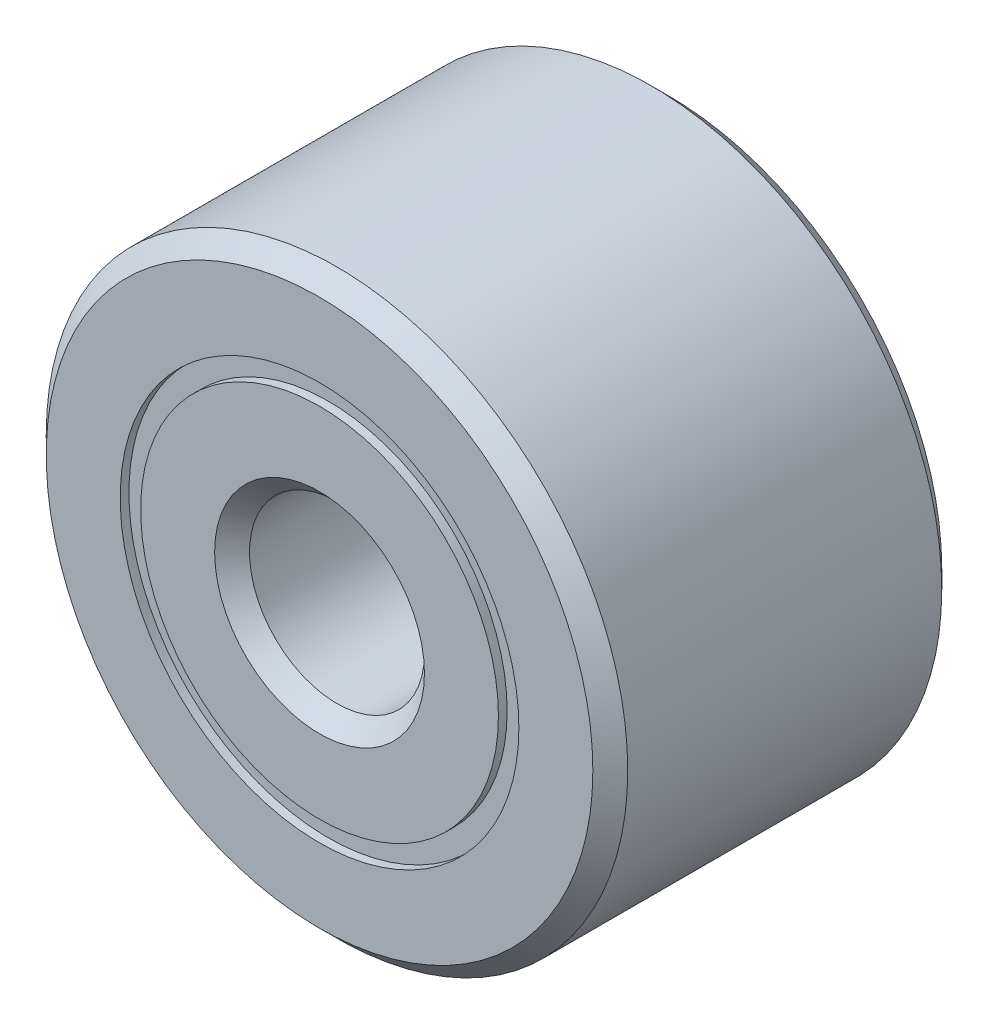
ISO-10303-21;
HEADER;
FILE_DESCRIPTION(('STEP AP214'),'2;1');
FILE_NAME('part.step','',(''),(''),'','','');
FILE_SCHEMA(('AUTOMOTIVE_DESIGN { 1 0 10303 214 1 1 1 1 }'));
ENDSEC;
DATA;
#1=APPLICATION_CONTEXT('core data for automotive mechanical design processes');
#2=APPLICATION_PROTOCOL_DEFINITION('international standard','automotive_design',2000,#1);
#3=PRODUCT_CONTEXT('',#1,'mechanical');
#4=PRODUCT('Part','Part','',(#3));
#5=PRODUCT_RELATED_PRODUCT_CATEGORY('part','',(#4));
#6=PRODUCT_DEFINITION_FORMATION('','',#4);
#7=PRODUCT_DEFINITION_CONTEXT('part definition',#1,'design');
#8=PRODUCT_DEFINITION('design','',#6,#7);
#9=PRODUCT_DEFINITION_SHAPE('','',#8);
#10=(LENGTH_UNIT() NAMED_UNIT(*) SI_UNIT(.MILLI.,.METRE.));
#11=(NAMED_UNIT(*) PLANE_ANGLE_UNIT() SI_UNIT($,.RADIAN.));
#12=(NAMED_UNIT(*) SI_UNIT($,.STERADIAN.) SOLID_ANGLE_UNIT());
#13=UNCERTAINTY_MEASURE_WITH_UNIT(LENGTH_MEASURE(1.E-05),#10,'distance_accuracy_value','');
#14=(GEOMETRIC_REPRESENTATION_CONTEXT(3) GLOBAL_UNCERTAINTY_ASSIGNED_CONTEXT((#13)) GLOBAL_UNIT_ASSIGNED_CONTEXT((#10,
#11,#12)) REPRESENTATION_CONTEXT('',''));
#15=CARTESIAN_POINT('',(0.,0.,0.));
#16=DIRECTION('',(0.,0.,1.));
#17=DIRECTION('',(1.,0.,0.));
#18=AXIS2_PLACEMENT_3D('',#15,#16,#17);
#19=CARTESIAN_POINT('',(0.,1.3604177197802,-1.13109375));
#20=DIRECTION('',(0.,0.,1.));
#21=DIRECTION('',(1.,0.,0.));
#22=AXIS2_PLACEMENT_3D('',#19,#20,#21);
#23=PLANE('',#22);
#24=CARTESIAN_POINT('',(0.,0.,-1.13109375));
#25=DIRECTION('',(0.,0.,1.));
#26=DIRECTION('',(1.,0.,0.));
#27=AXIS2_PLACEMENT_3D('',#24,#25,#26);
#28=CIRCLE('',#27,1.36041771978022);
#29=CARTESIAN_POINT('',(1.36041771978022,0.,-1.13109375));
#30=VERTEX_POINT('',#29);
#31=EDGE_CURVE('E57',#30,#30,#28,.T.);
#32=ORIENTED_EDGE('',*,*,#31,.F.);
#33=EDGE_LOOP('',(#32));
#34=FACE_BOUND('',#33,.T.);
#35=CARTESIAN_POINT('',(0.,0.,-1.13109375));
#36=DIRECTION('',(0.,0.,1.));
#37=DIRECTION('',(1.,0.,0.));
#38=AXIS2_PLACEMENT_3D('',#35,#36,#37);
#39=CIRCLE('',#38,1.22085728021978);
#40=CARTESIAN_POINT('',(1.22085728021978,0.,-1.13109375));
#41=VERTEX_POINT('',#40);
#42=EDGE_CURVE('E11',#41,#41,#39,.T.);
#43=ORIENTED_EDGE('',*,*,#42,.T.);
#44=EDGE_LOOP('',(#43));
#45=FACE_BOUND('',#44,.T.);
#46=ADVANCED_FACE('F43',(#34,#45),#23,.F.);
#47=CARTESIAN_POINT('',(0.,0.,1.19062499999999));
#48=DIRECTION('',(0.,0.,1.));
#49=DIRECTION('',(1.,0.,0.));
#50=AXIS2_PLACEMENT_3D('',#47,#48,#49);
#51=CYLINDRICAL_SURFACE('',#50,1.22085728021978);
#52=ORIENTED_EDGE('',*,*,#42,.F.);
#53=EDGE_LOOP('',(#52));
#54=FACE_BOUND('',#53,.T.);
#55=CARTESIAN_POINT('',(0.,0.,-0.533747730846405));
#56=DIRECTION('',(0.,0.,1.));
#57=DIRECTION('',(1.,0.,0.));
#58=AXIS2_PLACEMENT_3D('',#55,#56,#57);
#59=CIRCLE('',#58,1.22085728021978);
#60=CARTESIAN_POINT('',(1.22085728021978,0.,-0.533747730846405));
#61=VERTEX_POINT('',#60);
#62=EDGE_CURVE('E49',#61,#61,#59,.T.);
#63=ORIENTED_EDGE('',*,*,#62,.T.);
#64=EDGE_LOOP('',(#63));
#65=FACE_BOUND('',#64,.T.);
#66=ADVANCED_FACE('F66',(#54,#65),#51,.F.);
#67=CARTESIAN_POINT('',(0.,1.3604177197802,-0.533747730846404));
#68=DIRECTION('',(0.,0.,-1.));
#69=DIRECTION('',(-1.,0.,0.));
#70=AXIS2_PLACEMENT_3D('',#67,#68,#69);
#71=PLANE('',#70);
#72=ORIENTED_EDGE('',*,*,#62,.F.);
#73=EDGE_LOOP('',(#72));
#74=FACE_BOUND('',#73,.T.);
#75=CARTESIAN_POINT('',(0.,0.,-0.533747730846405));
#76=DIRECTION('',(0.,0.,1.));
#77=DIRECTION('',(1.,0.,0.));
#78=AXIS2_PLACEMENT_3D('',#75,#76,#77);
#79=CIRCLE('',#78,1.36041771978022);
#80=CARTESIAN_POINT('',(1.36041771978022,0.,-0.533747730846405));
#81=VERTEX_POINT('',#80);
#82=EDGE_CURVE('E53',#81,#81,#79,.T.);
#83=ORIENTED_EDGE('',*,*,#82,.T.);
#84=EDGE_LOOP('',(#83));
#85=FACE_BOUND('',#84,.T.);
#86=ADVANCED_FACE('F70',(#74,#85),#71,.F.);
#87=CARTESIAN_POINT('',(0.,0.,1.19062499999999));
#88=DIRECTION('',(0.,0.,1.));
#89=DIRECTION('',(1.,0.,0.));
#90=AXIS2_PLACEMENT_3D('',#87,#88,#89);
#91=CYLINDRICAL_SURFACE('',#90,1.36041771978022);
#92=ORIENTED_EDGE('',*,*,#82,.F.);
#93=EDGE_LOOP('',(#92));
#94=FACE_BOUND('',#93,.T.);
#95=ORIENTED_EDGE('',*,*,#31,.T.);
#96=EDGE_LOOP('',(#95));
#97=FACE_BOUND('',#96,.T.);
#98=ADVANCED_FACE('F63',(#94,#97),#91,.T.);
#99=CLOSED_SHELL('',(#46,#66,#86,#98));
#100=MANIFOLD_SOLID_BREP('B2',#99);
#101=CARTESIAN_POINT('',(0.,1.36041771978018,1.13109375));
#102=DIRECTION('',(0.,0.,-1.));
#103=DIRECTION('',(-1.,0.,0.));
#104=AXIS2_PLACEMENT_3D('',#101,#102,#103);
#105=PLANE('',#104);
#106=CARTESIAN_POINT('',(0.,0.,1.13109374999999));
#107=DIRECTION('',(0.,0.,1.));
#108=DIRECTION('',(1.,0.,0.));
#109=AXIS2_PLACEMENT_3D('',#106,#107,#108);
#110=CIRCLE('',#109,1.22085728021978);
#111=CARTESIAN_POINT('',(1.22085728021978,0.,1.13109374999999));
#112=VERTEX_POINT('',#111);
#113=EDGE_CURVE('E42',#112,#112,#110,.T.);
#114=ORIENTED_EDGE('',*,*,#113,.F.);
#115=EDGE_LOOP('',(#114));
#116=FACE_BOUND('',#115,.T.);
#117=CARTESIAN_POINT('',(0.,0.,1.13109374999999));
#118=DIRECTION('',(0.,0.,1.));
#119=DIRECTION('',(1.,0.,0.));
#120=AXIS2_PLACEMENT_3D('',#117,#118,#119);
#121=CIRCLE('',#120,1.36041771978022);
#122=CARTESIAN_POINT('',(1.36041771978022,0.,1.13109374999999));
#123=VERTEX_POINT('',#122);
#124=EDGE_CURVE('E124',#123,#123,#121,.T.);
#125=ORIENTED_EDGE('',*,*,#124,.T.);
#126=EDGE_LOOP('',(#125));
#127=FACE_BOUND('',#126,.T.);
#128=ADVANCED_FACE('F110',(#116,#127),#105,.F.);
#129=CARTESIAN_POINT('',(0.,0.,1.190625));
#130=DIRECTION('',(0.,0.,1.));
#131=DIRECTION('',(1.,0.,0.));
#132=AXIS2_PLACEMENT_3D('',#129,#130,#131);
#133=CYLINDRICAL_SURFACE('',#132,1.22085728021978);
#134=CARTESIAN_POINT('',(0.,0.,0.533747730846405));
#135=DIRECTION('',(0.,0.,1.));
#136=DIRECTION('',(1.,0.,0.));
#137=AXIS2_PLACEMENT_3D('',#134,#135,#136);
#138=CIRCLE('',#137,1.22085728021978);
#139=CARTESIAN_POINT('',(1.22085728021978,0.,0.533747730846405));
#140=VERTEX_POINT('',#139);
#141=EDGE_CURVE('E116',#140,#140,#138,.T.);
#142=ORIENTED_EDGE('',*,*,#141,.F.);
#143=EDGE_LOOP('',(#142));
#144=FACE_BOUND('',#143,.T.);
#145=ORIENTED_EDGE('',*,*,#113,.T.);
#146=EDGE_LOOP('',(#145));
#147=FACE_BOUND('',#146,.T.);
#148=ADVANCED_FACE('F139',(#144,#147),#133,.F.);
#149=CARTESIAN_POINT('',(0.,1.36041771978018,0.533747730846407));
#150=DIRECTION('',(0.,0.,1.));
#151=DIRECTION('',(1.,0.,0.));
#152=AXIS2_PLACEMENT_3D('',#149,#150,#151);
#153=PLANE('',#152);
#154=CARTESIAN_POINT('',(0.,0.,0.533747730846405));
#155=DIRECTION('',(0.,0.,1.));
#156=DIRECTION('',(1.,0.,0.));
#157=AXIS2_PLACEMENT_3D('',#154,#155,#156);
#158=CIRCLE('',#157,1.36041771978022);
#159=CARTESIAN_POINT('',(1.36041771978022,0.,0.533747730846405));
#160=VERTEX_POINT('',#159);
#161=EDGE_CURVE('E120',#160,#160,#158,.T.);
#162=ORIENTED_EDGE('',*,*,#161,.F.);
#163=EDGE_LOOP('',(#162));
#164=FACE_BOUND('',#163,.T.);
#165=ORIENTED_EDGE('',*,*,#141,.T.);
#166=EDGE_LOOP('',(#165));
#167=FACE_BOUND('',#166,.T.);
#168=ADVANCED_FACE('F134',(#164,#167),#153,.F.);
#169=CARTESIAN_POINT('',(0.,0.,1.190625));
#170=DIRECTION('',(0.,0.,1.));
#171=DIRECTION('',(1.,0.,0.));
#172=AXIS2_PLACEMENT_3D('',#169,#170,#171);
#173=CYLINDRICAL_SURFACE('',#172,1.36041771978022);
#174=ORIENTED_EDGE('',*,*,#124,.F.);
#175=EDGE_LOOP('',(#174));
#176=FACE_BOUND('',#175,.T.);
#177=ORIENTED_EDGE('',*,*,#161,.T.);
#178=EDGE_LOOP('',(#177));
#179=FACE_BOUND('',#178,.T.);
#180=ADVANCED_FACE('F131',(#176,#179),#173,.T.);
#181=CLOSED_SHELL('',(#128,#148,#168,#180));
#182=MANIFOLD_SOLID_BREP('B6',#181);
#183=CARTESIAN_POINT('',(-1.1177248620768,0.645318749999985,0.));
#184=DIRECTION('',(0.,0.,1.));
#185=DIRECTION('',(-0.866025403784434,0.50000000000001,0.));
#186=AXIS2_PLACEMENT_3D('',#183,#184,#185);
#187=SPHERICAL_SURFACE('',#186,0.533747730846405);
#188=CARTESIAN_POINT('',(-1.1177248620768,0.645318749999985,0.533747730846405));
#189=VERTEX_POINT('',#188);
#190=VERTEX_LOOP('',#189);
#191=FACE_BOUND('',#190,.T.);
#192=ADVANCED_FACE('F177',(#191),#187,.T.);
#193=CLOSED_SHELL('',(#192));
#194=MANIFOLD_SOLID_BREP('B37',#193);
#195=CARTESIAN_POINT('',(-1.11772486207683,-0.645318749999992,0.));
#196=DIRECTION('',(0.,0.,1.));
#197=DIRECTION('',(-0.866025403784444,-0.499999999999992,0.));
#198=AXIS2_PLACEMENT_3D('',#195,#196,#197);
#199=SPHERICAL_SURFACE('',#198,0.533747730846405);
#200=CARTESIAN_POINT('',(-1.11772486207683,-0.645318749999992,0.533747730846407));
#201=VERTEX_POINT('',#200);
#202=VERTEX_LOOP('',#201);
#203=FACE_BOUND('',#202,.T.);
#204=ADVANCED_FACE('F197',(#203),#199,.T.);
#205=CLOSED_SHELL('',(#204));
#206=MANIFOLD_SOLID_BREP('B106',#205);
#207=CARTESIAN_POINT('',(0.,-1.29063750000001,0.));
#208=DIRECTION('',(0.,0.,1.));
#209=DIRECTION('',(0.,-1.,0.));
#210=AXIS2_PLACEMENT_3D('',#207,#208,#209);
#211=SPHERICAL_SURFACE('',#210,0.533747730846405);
#212=CARTESIAN_POINT('',(0.,-1.29063750000001,0.533747730846405));
#213=VERTEX_POINT('',#212);
#214=VERTEX_LOOP('',#213);
#215=FACE_BOUND('',#214,.T.);
#216=ADVANCED_FACE('F217',(#215),#211,.T.);
#217=CLOSED_SHELL('',(#216));
#218=MANIFOLD_SOLID_BREP('B173',#217);
#219=CARTESIAN_POINT('',(1.11772486207685,-0.645318750000026,0.));
#220=DIRECTION('',(0.,0.,1.));
#221=DIRECTION('',(0.866025403784437,-0.500000000000004,0.));
#222=AXIS2_PLACEMENT_3D('',#219,#220,#221);
#223=SPHERICAL_SURFACE('',#222,0.533747730846405);
#224=CARTESIAN_POINT('',(1.11772486207685,-0.645318750000026,0.533747730846404));
#225=VERTEX_POINT('',#224);
#226=VERTEX_LOOP('',#225);
#227=FACE_BOUND('',#226,.T.);
#228=ADVANCED_FACE('F237',(#227),#223,.T.);
#229=CLOSED_SHELL('',(#228));
#230=MANIFOLD_SOLID_BREP('B193',#229);
#231=CARTESIAN_POINT('',(1.11772486207687,0.645318749999971,0.));
#232=DIRECTION('',(0.,0.,1.));
#233=DIRECTION('',(0.866025403784441,0.499999999999998,0.));
#234=AXIS2_PLACEMENT_3D('',#231,#232,#233);
#235=SPHERICAL_SURFACE('',#234,0.533747730846405);
#236=CARTESIAN_POINT('',(1.11772486207687,0.645318749999971,0.533747730846406));
#237=VERTEX_POINT('',#236);
#238=VERTEX_LOOP('',#237);
#239=FACE_BOUND('',#238,.T.);
#240=ADVANCED_FACE('F257',(#239),#235,.T.);
#241=CLOSED_SHELL('',(#240));
#242=MANIFOLD_SOLID_BREP('B213',#241);
#243=CARTESIAN_POINT('',(0.,1.29063749999999,0.));
#244=DIRECTION('',(0.,0.,1.));
#245=DIRECTION('',(0.,1.,0.));
#246=AXIS2_PLACEMENT_3D('',#243,#244,#245);
#247=SPHERICAL_SURFACE('',#246,0.533747730846405);
#248=CARTESIAN_POINT('',(0.,1.29063749999999,0.533747730846407));
#249=VERTEX_POINT('',#248);
#250=VERTEX_LOOP('',#249);
#251=FACE_BOUND('',#250,.T.);
#252=ADVANCED_FACE('F279',(#251),#247,.T.);
#253=CLOSED_SHELL('',(#252));
#254=MANIFOLD_SOLID_BREP('B233',#253);
#255=CARTESIAN_POINT('',(0.,1.22085728021978,1.19062499999999));
#256=DIRECTION('',(0.,0.,-1.));
#257=DIRECTION('',(-1.,0.,0.));
#258=AXIS2_PLACEMENT_3D('',#255,#256,#257);
#259=PLANE('',#258);
#260=CARTESIAN_POINT('',(0.,0.,1.19062499999999));
#261=DIRECTION('',(0.,0.,1.));
#262=DIRECTION('',(1.,0.,0.));
#263=AXIS2_PLACEMENT_3D('',#260,#261,#262);
#264=CIRCLE('',#263,0.7159625);
#265=CARTESIAN_POINT('',(0.715962500000001,0.,1.19062499999999));
#266=VERTEX_POINT('',#265);
#267=EDGE_CURVE('E326',#266,#266,#264,.T.);
#268=ORIENTED_EDGE('',*,*,#267,.F.);
#269=EDGE_LOOP('',(#268));
#270=FACE_BOUND('',#269,.T.);
#271=CARTESIAN_POINT('',(0.,0.,1.19062499999999));
#272=DIRECTION('',(0.,0.,1.));
#273=DIRECTION('',(1.,0.,0.));
#274=AXIS2_PLACEMENT_3D('',#271,#272,#273);
#275=CIRCLE('',#274,1.22085728021978);
#276=CARTESIAN_POINT('',(1.22085728021978,0.,1.19062499999999));
#277=VERTEX_POINT('',#276);
#278=EDGE_CURVE('E278',#277,#277,#275,.T.);
#279=ORIENTED_EDGE('',*,*,#278,.T.);
#280=EDGE_LOOP('',(#279));
#281=FACE_BOUND('',#280,.T.);
#282=ADVANCED_FACE('F298',(#270,#281),#259,.F.);
#283=CARTESIAN_POINT('',(0.,0.,1.19062499999999));
#284=DIRECTION('',(0.,0.,1.));
#285=DIRECTION('',(1.,0.,0.));
#286=AXIS2_PLACEMENT_3D('',#283,#284,#285);
#287=CYLINDRICAL_SURFACE('',#286,1.22085728021978);
#288=ORIENTED_EDGE('',*,*,#278,.F.);
#289=EDGE_LOOP('',(#288));
#290=FACE_BOUND('',#289,.T.);
#291=CARTESIAN_POINT('',(0.,0.,0.529166666666666));
#292=DIRECTION('',(0.,0.,1.));
#293=DIRECTION('',(1.,0.,0.));
#294=AXIS2_PLACEMENT_3D('',#291,#292,#293);
#295=CIRCLE('',#294,1.22085728021978);
#296=CARTESIAN_POINT('',(1.22085728021978,0.,0.529166666666665));
#297=VERTEX_POINT('',#296);
#298=EDGE_CURVE('E304',#297,#297,#295,.T.);
#299=ORIENTED_EDGE('',*,*,#298,.T.);
#300=EDGE_LOOP('',(#299));
#301=FACE_BOUND('',#300,.T.);
#302=ADVANCED_FACE('F333',(#290,#301),#287,.T.);
#303=CARTESIAN_POINT('',(0.,0.,0.));
#304=DIRECTION('',(0.,0.,1.));
#305=DIRECTION('',(1.,0.,0.));
#306=AXIS2_PLACEMENT_3D('',#303,#304,#305);
#307=TOROIDAL_SURFACE('',#306,1.29063749999999,0.533747730846405);
#308=ORIENTED_EDGE('',*,*,#298,.F.);
#309=EDGE_LOOP('',(#308));
#310=FACE_BOUND('',#309,.T.);
#311=CARTESIAN_POINT('',(0.,0.,-0.529166666666667));
#312=DIRECTION('',(0.,0.,1.));
#313=DIRECTION('',(1.,0.,0.));
#314=AXIS2_PLACEMENT_3D('',#311,#312,#313);
#315=CIRCLE('',#314,1.22085728021978);
#316=CARTESIAN_POINT('',(1.22085728021978,0.,-0.529166666666668));
#317=VERTEX_POINT('',#316);
#318=EDGE_CURVE('E308',#317,#317,#315,.T.);
#319=ORIENTED_EDGE('',*,*,#318,.T.);
#320=EDGE_LOOP('',(#319));
#321=FACE_BOUND('',#320,.T.);
#322=ADVANCED_FACE('F337',(#310,#321),#307,.F.);
#323=CARTESIAN_POINT('',(0.,0.,1.19062499999999));
#324=DIRECTION('',(0.,0.,1.));
#325=DIRECTION('',(1.,0.,0.));
#326=AXIS2_PLACEMENT_3D('',#323,#324,#325);
#327=CYLINDRICAL_SURFACE('',#326,1.22085728021978);
#328=ORIENTED_EDGE('',*,*,#318,.F.);
#329=EDGE_LOOP('',(#328));
#330=FACE_BOUND('',#329,.T.);
#331=CARTESIAN_POINT('',(0.,0.,-1.190625));
#332=DIRECTION('',(0.,0.,1.));
#333=DIRECTION('',(1.,0.,0.));
#334=AXIS2_PLACEMENT_3D('',#331,#332,#333);
#335=CIRCLE('',#334,1.22085728021978);
#336=CARTESIAN_POINT('',(1.22085728021978,0.,-1.190625));
#337=VERTEX_POINT('',#336);
#338=EDGE_CURVE('E312',#337,#337,#335,.T.);
#339=ORIENTED_EDGE('',*,*,#338,.T.);
#340=EDGE_LOOP('',(#339));
#341=FACE_BOUND('',#340,.T.);
#342=ADVANCED_FACE('F342',(#330,#341),#327,.T.);
#343=CARTESIAN_POINT('',(0.,0.715962499999986,-1.190625));
#344=DIRECTION('',(0.,0.,1.));
#345=DIRECTION('',(1.,0.,0.));
#346=AXIS2_PLACEMENT_3D('',#343,#344,#345);
#347=PLANE('',#346);
#348=ORIENTED_EDGE('',*,*,#338,.F.);
#349=EDGE_LOOP('',(#348));
#350=FACE_BOUND('',#349,.T.);
#351=CARTESIAN_POINT('',(0.,0.,-1.190625));
#352=DIRECTION('',(0.,0.,1.));
#353=DIRECTION('',(1.,0.,0.));
#354=AXIS2_PLACEMENT_3D('',#351,#352,#353);
#355=CIRCLE('',#354,0.7159625);
#356=CARTESIAN_POINT('',(0.715962500000001,0.,-1.190625));
#357=VERTEX_POINT('',#356);
#358=EDGE_CURVE('E317',#357,#357,#355,.T.);
#359=ORIENTED_EDGE('',*,*,#358,.T.);
#360=EDGE_LOOP('',(#359));
#361=FACE_BOUND('',#360,.T.);
#362=ADVANCED_FACE('F348',(#350,#361),#347,.F.);
#363=CARTESIAN_POINT('',(0.,0.,-1.0715625));
#364=DIRECTION('',(0.,0.,-1.));
#365=DIRECTION('',(-1.,0.,0.));
#366=AXIS2_PLACEMENT_3D('',#363,#364,#365);
#367=CONICAL_SURFACE('',#366,0.5969,0.785398163397452);
#368=ORIENTED_EDGE('',*,*,#358,.F.);
#369=EDGE_LOOP('',(#368));
#370=FACE_BOUND('',#369,.T.);
#371=CARTESIAN_POINT('',(0.,0.,-1.0715625));
#372=DIRECTION('',(0.,0.,1.));
#373=DIRECTION('',(1.,0.,0.));
#374=AXIS2_PLACEMENT_3D('',#371,#372,#373);
#375=CIRCLE('',#374,0.5969);
#376=CARTESIAN_POINT('',(0.596900000000001,0.,-1.0715625));
#377=VERTEX_POINT('',#376);
#378=EDGE_CURVE('E320',#377,#377,#375,.T.);
#379=ORIENTED_EDGE('',*,*,#378,.T.);
#380=EDGE_LOOP('',(#379));
#381=FACE_BOUND('',#380,.T.);
#382=ADVANCED_FACE('F352',(#370,#381),#367,.F.);
#383=CARTESIAN_POINT('',(0.,0.,1.19062499999999));
#384=DIRECTION('',(0.,0.,1.));
#385=DIRECTION('',(1.,0.,0.));
#386=AXIS2_PLACEMENT_3D('',#383,#384,#385);
#387=CYLINDRICAL_SURFACE('',#386,0.5969);
#388=ORIENTED_EDGE('',*,*,#378,.F.);
#389=EDGE_LOOP('',(#388));
#390=FACE_BOUND('',#389,.T.);
#391=CARTESIAN_POINT('',(0.,0.,1.0715625));
#392=DIRECTION('',(0.,0.,1.));
#393=DIRECTION('',(1.,0.,0.));
#394=AXIS2_PLACEMENT_3D('',#391,#392,#393);
#395=CIRCLE('',#394,0.5969);
#396=CARTESIAN_POINT('',(0.596900000000001,0.,1.0715625));
#397=VERTEX_POINT('',#396);
#398=EDGE_CURVE('E323',#397,#397,#395,.T.);
#399=ORIENTED_EDGE('',*,*,#398,.T.);
#400=EDGE_LOOP('',(#399));
#401=FACE_BOUND('',#400,.T.);
#402=ADVANCED_FACE('F356',(#390,#401),#387,.F.);
#403=CARTESIAN_POINT('',(0.,0.,1.19062499999999));
#404=DIRECTION('',(0.,0.,1.));
#405=DIRECTION('',(1.,0.,0.));
#406=AXIS2_PLACEMENT_3D('',#403,#404,#405);
#407=CONICAL_SURFACE('',#406,0.7159625,0.785398163397449);
#408=ORIENTED_EDGE('',*,*,#398,.F.);
#409=EDGE_LOOP('',(#408));
#410=FACE_BOUND('',#409,.T.);
#411=ORIENTED_EDGE('',*,*,#267,.T.);
#412=EDGE_LOOP('',(#411));
#413=FACE_BOUND('',#412,.T.);
#414=ADVANCED_FACE('F330',(#410,#413),#407,.F.);
#415=CLOSED_SHELL('',(#282,#302,#322,#342,#362,#382,#402,#414));
#416=MANIFOLD_SOLID_BREP('B253',#415);
#417=CARTESIAN_POINT('',(0.,0.,1.0715625));
#418=DIRECTION('',(0.,0.,-1.));
#419=DIRECTION('',(-1.,0.,0.));
#420=AXIS2_PLACEMENT_3D('',#417,#418,#419);
#421=CONICAL_SURFACE('',#420,1.984375,0.785398163397446);
#422=CARTESIAN_POINT('',(0.,0.,1.190625));
#423=DIRECTION('',(0.,0.,1.));
#424=DIRECTION('',(1.,0.,0.));
#425=AXIS2_PLACEMENT_3D('',#422,#423,#424);
#426=CIRCLE('',#425,1.8653125);
#427=CARTESIAN_POINT('',(1.8653125,0.,1.190625));
#428=VERTEX_POINT('',#427);
#429=EDGE_CURVE('E447',#428,#428,#426,.T.);
#430=ORIENTED_EDGE('',*,*,#429,.F.);
#431=EDGE_LOOP('',(#430));
#432=FACE_BOUND('',#431,.T.);
#433=CARTESIAN_POINT('',(0.,0.,1.0715625));
#434=DIRECTION('',(0.,0.,1.));
#435=DIRECTION('',(1.,0.,0.));
#436=AXIS2_PLACEMENT_3D('',#433,#434,#435);
#437=CIRCLE('',#436,1.984375);
#438=CARTESIAN_POINT('',(1.984375,0.,1.0715625));
#439=VERTEX_POINT('',#438);
#440=EDGE_CURVE('E297',#439,#439,#437,.T.);
#441=ORIENTED_EDGE('',*,*,#440,.T.);
#442=EDGE_LOOP('',(#441));
#443=FACE_BOUND('',#442,.T.);
#444=ADVANCED_FACE('F419',(#432,#443),#421,.T.);
#445=CARTESIAN_POINT('',(0.,0.,1.190625));
#446=DIRECTION('',(0.,0.,1.));
#447=DIRECTION('',(1.,0.,0.));
#448=AXIS2_PLACEMENT_3D('',#445,#446,#447);
#449=CYLINDRICAL_SURFACE('',#448,1.984375);
#450=ORIENTED_EDGE('',*,*,#440,.F.);
#451=EDGE_LOOP('',(#450));
#452=FACE_BOUND('',#451,.T.);
#453=CARTESIAN_POINT('',(0.,0.,-1.0715625));
#454=DIRECTION('',(0.,0.,1.));
#455=DIRECTION('',(1.,0.,0.));
#456=AXIS2_PLACEMENT_3D('',#453,#454,#455);
#457=CIRCLE('',#456,1.984375);
#458=CARTESIAN_POINT('',(1.984375,0.,-1.0715625));
#459=VERTEX_POINT('',#458);
#460=EDGE_CURVE('E425',#459,#459,#457,.T.);
#461=ORIENTED_EDGE('',*,*,#460,.T.);
#462=EDGE_LOOP('',(#461));
#463=FACE_BOUND('',#462,.T.);
#464=ADVANCED_FACE('F454',(#452,#463),#449,.T.);
#465=CARTESIAN_POINT('',(0.,0.,-1.190625));
#466=DIRECTION('',(0.,0.,1.));
#467=DIRECTION('',(1.,0.,0.));
#468=AXIS2_PLACEMENT_3D('',#465,#466,#467);
#469=CONICAL_SURFACE('',#468,1.8653125,0.785398163397447);
#470=ORIENTED_EDGE('',*,*,#460,.F.);
#471=EDGE_LOOP('',(#470));
#472=FACE_BOUND('',#471,.T.);
#473=CARTESIAN_POINT('',(0.,0.,-1.190625));
#474=DIRECTION('',(0.,0.,1.));
#475=DIRECTION('',(1.,0.,0.));
#476=AXIS2_PLACEMENT_3D('',#473,#474,#475);
#477=CIRCLE('',#476,1.8653125);
#478=CARTESIAN_POINT('',(1.8653125,0.,-1.190625));
#479=VERTEX_POINT('',#478);
#480=EDGE_CURVE('E429',#479,#479,#477,.T.);
#481=ORIENTED_EDGE('',*,*,#480,.T.);
#482=EDGE_LOOP('',(#481));
#483=FACE_BOUND('',#482,.T.);
#484=ADVANCED_FACE('F458',(#472,#483),#469,.T.);
#485=CARTESIAN_POINT('',(0.,1.86531249999998,-1.190625));
#486=DIRECTION('',(0.,0.,1.));
#487=DIRECTION('',(1.,0.,0.));
#488=AXIS2_PLACEMENT_3D('',#485,#486,#487);
#489=PLANE('',#488);
#490=ORIENTED_EDGE('',*,*,#480,.F.);
#491=EDGE_LOOP('',(#490));
#492=FACE_BOUND('',#491,.T.);
#493=CARTESIAN_POINT('',(0.,0.,-1.190625));
#494=DIRECTION('',(0.,0.,1.));
#495=DIRECTION('',(1.,0.,0.));
#496=AXIS2_PLACEMENT_3D('',#493,#494,#495);
#497=CIRCLE('',#496,1.36041771978022);
#498=CARTESIAN_POINT('',(1.36041771978022,0.,-1.190625));
#499=VERTEX_POINT('',#498);
#500=EDGE_CURVE('E433',#499,#499,#497,.T.);
#501=ORIENTED_EDGE('',*,*,#500,.T.);
#502=EDGE_LOOP('',(#501));
#503=FACE_BOUND('',#502,.T.);
#504=ADVANCED_FACE('F463',(#492,#503),#489,.F.);
#505=CARTESIAN_POINT('',(0.,0.,1.190625));
#506=DIRECTION('',(0.,0.,1.));
#507=DIRECTION('',(1.,0.,0.));
#508=AXIS2_PLACEMENT_3D('',#505,#506,#507);
#509=CYLINDRICAL_SURFACE('',#508,1.36041771978022);
#510=ORIENTED_EDGE('',*,*,#500,.F.);
#511=EDGE_LOOP('',(#510));
#512=FACE_BOUND('',#511,.T.);
#513=CARTESIAN_POINT('',(0.,0.,-0.529166666666667));
#514=DIRECTION('',(0.,0.,1.));
#515=DIRECTION('',(1.,0.,0.));
#516=AXIS2_PLACEMENT_3D('',#513,#514,#515);
#517=CIRCLE('',#516,1.36041771978022);
#518=CARTESIAN_POINT('',(1.36041771978022,0.,-0.529166666666668));
#519=VERTEX_POINT('',#518);
#520=EDGE_CURVE('E438',#519,#519,#517,.T.);
#521=ORIENTED_EDGE('',*,*,#520,.T.);
#522=EDGE_LOOP('',(#521));
#523=FACE_BOUND('',#522,.T.);
#524=ADVANCED_FACE('F469',(#512,#523),#509,.F.);
#525=CARTESIAN_POINT('',(0.,0.,0.));
#526=DIRECTION('',(0.,0.,1.));
#527=DIRECTION('',(1.,0.,0.));
#528=AXIS2_PLACEMENT_3D('',#525,#526,#527);
#529=TOROIDAL_SURFACE('',#528,1.2906375,0.533747730846405);
#530=ORIENTED_EDGE('',*,*,#520,.F.);
#531=EDGE_LOOP('',(#530));
#532=FACE_BOUND('',#531,.T.);
#533=CARTESIAN_POINT('',(0.,0.,0.529166666666667));
#534=DIRECTION('',(0.,0.,1.));
#535=DIRECTION('',(1.,0.,0.));
#536=AXIS2_PLACEMENT_3D('',#533,#534,#535);
#537=CIRCLE('',#536,1.36041771978022);
#538=CARTESIAN_POINT('',(1.36041771978022,0.,0.529166666666667));
#539=VERTEX_POINT('',#538);
#540=EDGE_CURVE('E441',#539,#539,#537,.T.);
#541=ORIENTED_EDGE('',*,*,#540,.T.);
#542=EDGE_LOOP('',(#541));
#543=FACE_BOUND('',#542,.T.);
#544=ADVANCED_FACE('F473',(#532,#543),#529,.F.);
#545=CARTESIAN_POINT('',(0.,0.,1.190625));
#546=DIRECTION('',(0.,0.,1.));
#547=DIRECTION('',(1.,0.,0.));
#548=AXIS2_PLACEMENT_3D('',#545,#546,#547);
#549=CYLINDRICAL_SURFACE('',#548,1.36041771978022);
#550=ORIENTED_EDGE('',*,*,#540,.F.);
#551=EDGE_LOOP('',(#550));
#552=FACE_BOUND('',#551,.T.);
#553=CARTESIAN_POINT('',(0.,0.,1.190625));
#554=DIRECTION('',(0.,0.,1.));
#555=DIRECTION('',(1.,0.,0.));
#556=AXIS2_PLACEMENT_3D('',#553,#554,#555);
#557=CIRCLE('',#556,1.36041771978022);
#558=CARTESIAN_POINT('',(1.36041771978022,0.,1.190625));
#559=VERTEX_POINT('',#558);
#560=EDGE_CURVE('E444',#559,#559,#557,.T.);
#561=ORIENTED_EDGE('',*,*,#560,.T.);
#562=EDGE_LOOP('',(#561));
#563=FACE_BOUND('',#562,.T.);
#564=ADVANCED_FACE('F477',(#552,#563),#549,.F.);
#565=CARTESIAN_POINT('',(0.,1.86531249999998,1.190625));
#566=DIRECTION('',(0.,0.,-1.));
#567=DIRECTION('',(-1.,0.,0.));
#568=AXIS2_PLACEMENT_3D('',#565,#566,#567);
#569=PLANE('',#568);
#570=ORIENTED_EDGE('',*,*,#560,.F.);
#571=EDGE_LOOP('',(#570));
#572=FACE_BOUND('',#571,.T.);
#573=ORIENTED_EDGE('',*,*,#429,.T.);
#574=EDGE_LOOP('',(#573));
#575=FACE_BOUND('',#574,.T.);
#576=ADVANCED_FACE('F451',(#572,#575),#569,.F.);
#577=CLOSED_SHELL('',(#444,#464,#484,#504,#524,#544,#564,#576));
#578=MANIFOLD_SOLID_BREP('B273',#577);
#579=ADVANCED_BREP_SHAPE_REPRESENTATION('',(#18,#100,#182,#194,#206,#218,#230,#242,#254,#416,
#578),#14);
#580=SHAPE_DEFINITION_REPRESENTATION(#9,#579);
ENDSEC;
END-ISO-10303-21;
